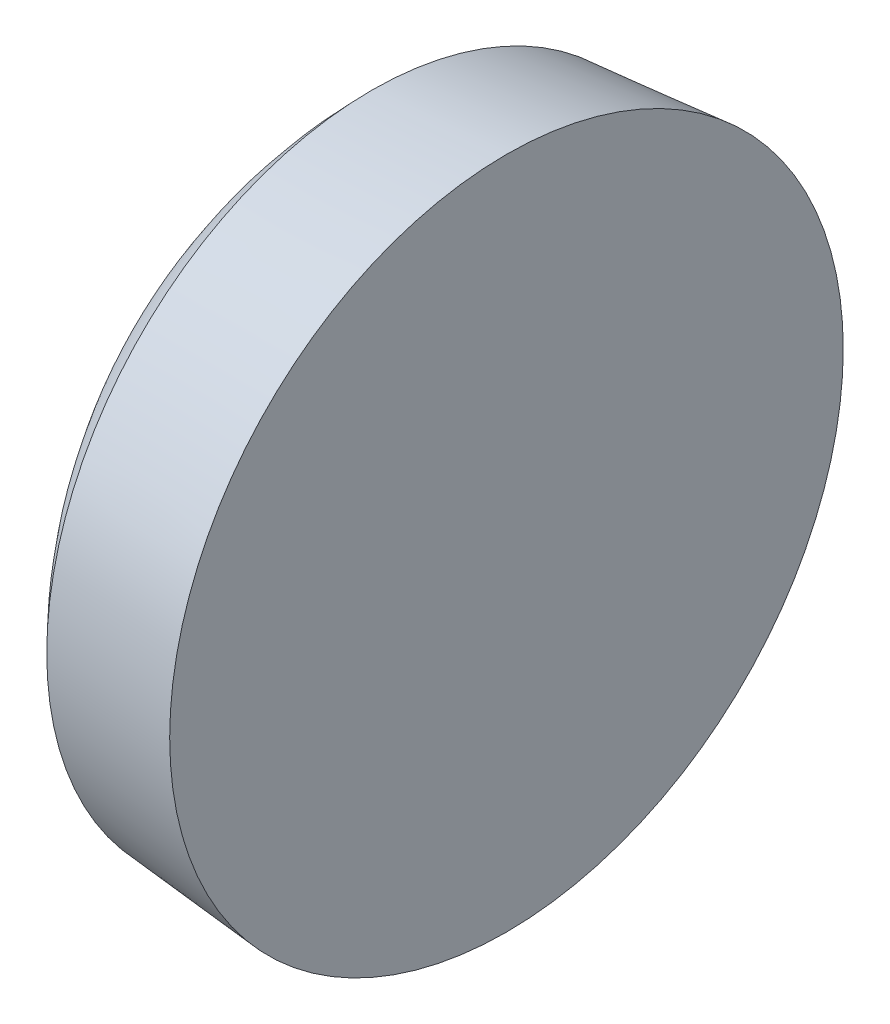
ISO-10303-21;
HEADER;
FILE_DESCRIPTION(('STEP AP214'),'2;1');
FILE_NAME('part.step','',(''),(''),'','','');
FILE_SCHEMA(('AUTOMOTIVE_DESIGN { 1 0 10303 214 1 1 1 1 }'));
ENDSEC;
DATA;
#1=APPLICATION_CONTEXT('core data for automotive mechanical design processes');
#2=APPLICATION_PROTOCOL_DEFINITION('international standard','automotive_design',2000,#1);
#3=PRODUCT_CONTEXT('',#1,'mechanical');
#4=PRODUCT('Part','Part','',(#3));
#5=PRODUCT_RELATED_PRODUCT_CATEGORY('part','',(#4));
#6=PRODUCT_DEFINITION_FORMATION('','',#4);
#7=PRODUCT_DEFINITION_CONTEXT('part definition',#1,'design');
#8=PRODUCT_DEFINITION('design','',#6,#7);
#9=PRODUCT_DEFINITION_SHAPE('','',#8);
#10=(LENGTH_UNIT() NAMED_UNIT(*) SI_UNIT(.MILLI.,.METRE.));
#11=(NAMED_UNIT(*) PLANE_ANGLE_UNIT() SI_UNIT($,.RADIAN.));
#12=(NAMED_UNIT(*) SI_UNIT($,.STERADIAN.) SOLID_ANGLE_UNIT());
#13=UNCERTAINTY_MEASURE_WITH_UNIT(LENGTH_MEASURE(1.E-05),#10,'distance_accuracy_value','');
#14=(GEOMETRIC_REPRESENTATION_CONTEXT(3) GLOBAL_UNCERTAINTY_ASSIGNED_CONTEXT((#13)) GLOBAL_UNIT_ASSIGNED_CONTEXT((#10,
#11,#12)) REPRESENTATION_CONTEXT('',''));
#15=CARTESIAN_POINT('',(0.,0.,0.));
#16=DIRECTION('',(0.,0.,1.));
#17=DIRECTION('',(1.,0.,0.));
#18=AXIS2_PLACEMENT_3D('',#15,#16,#17);
#19=CARTESIAN_POINT('',(60.9333333333333,6.9,10.));
#20=DIRECTION('',(-1.,0.,0.));
#21=DIRECTION('',(0.,0.,1.));
#22=AXIS2_PLACEMENT_3D('',#19,#20,#21);
#23=PLANE('',#22);
#24=DIRECTION('',(0.,0.,-1.));
#25=VECTOR('',#24,1.);
#26=CARTESIAN_POINT('',(60.9333333333333,7.85,10.));
#27=LINE('',#26,#25);
#28=CARTESIAN_POINT('',(60.9333333333333,7.85,9.82));
#29=VERTEX_POINT('',#28);
#30=CARTESIAN_POINT('',(60.9333333333333,7.85,10.18));
#31=VERTEX_POINT('',#30);
#32=EDGE_CURVE('E293',#29,#31,#27,.F.);
#33=ORIENTED_EDGE('',*,*,#32,.F.);
#34=DIRECTION('',(0.,1.,0.));
#35=VECTOR('',#34,1.);
#36=CARTESIAN_POINT('',(60.9333333333333,6.9,9.82));
#37=LINE('',#36,#35);
#38=CARTESIAN_POINT('',(60.9333333333333,7.08,9.82));
#39=VERTEX_POINT('',#38);
#40=EDGE_CURVE('E298',#39,#29,#37,.T.);
#41=ORIENTED_EDGE('',*,*,#40,.F.);
#42=DIRECTION('',(0.,0.,-1.));
#43=VECTOR('',#42,1.);
#44=CARTESIAN_POINT('',(60.9333333333333,7.08,10.));
#45=LINE('',#44,#43);
#46=CARTESIAN_POINT('',(60.9333333333333,7.08,9.05));
#47=VERTEX_POINT('',#46);
#48=EDGE_CURVE('E303',#47,#39,#45,.F.);
#49=ORIENTED_EDGE('',*,*,#48,.F.);
#50=DIRECTION('',(0.,1.,0.));
#51=VECTOR('',#50,1.);
#52=CARTESIAN_POINT('',(60.9333333333333,6.9,9.05));
#53=LINE('',#52,#51);
#54=CARTESIAN_POINT('',(60.9333333333333,6.72,9.05));
#55=VERTEX_POINT('',#54);
#56=EDGE_CURVE('E308',#55,#47,#53,.T.);
#57=ORIENTED_EDGE('',*,*,#56,.F.);
#58=DIRECTION('',(0.,0.,1.));
#59=VECTOR('',#58,1.);
#60=CARTESIAN_POINT('',(60.9333333333333,6.72,10.));
#61=LINE('',#60,#59);
#62=CARTESIAN_POINT('',(60.9333333333333,6.72,9.82));
#63=VERTEX_POINT('',#62);
#64=EDGE_CURVE('E313',#63,#55,#61,.F.);
#65=ORIENTED_EDGE('',*,*,#64,.F.);
#66=DIRECTION('',(0.,1.,0.));
#67=VECTOR('',#66,1.);
#68=CARTESIAN_POINT('',(60.9333333333333,6.9,9.82));
#69=LINE('',#68,#67);
#70=CARTESIAN_POINT('',(60.9333333333333,5.95,9.82));
#71=VERTEX_POINT('',#70);
#72=EDGE_CURVE('E318',#71,#63,#69,.T.);
#73=ORIENTED_EDGE('',*,*,#72,.F.);
#74=DIRECTION('',(0.,0.,-1.));
#75=VECTOR('',#74,1.);
#76=CARTESIAN_POINT('',(60.9333333333333,5.95,10.));
#77=LINE('',#76,#75);
#78=CARTESIAN_POINT('',(60.9333333333333,5.95,10.18));
#79=VERTEX_POINT('',#78);
#80=EDGE_CURVE('E267',#71,#79,#77,.F.);
#81=ORIENTED_EDGE('',*,*,#80,.T.);
#82=DIRECTION('',(0.,1.,0.));
#83=VECTOR('',#82,1.);
#84=CARTESIAN_POINT('',(60.9333333333333,6.9,10.18));
#85=LINE('',#84,#83);
#86=CARTESIAN_POINT('',(60.9333333333333,6.72,10.18));
#87=VERTEX_POINT('',#86);
#88=EDGE_CURVE('E264',#87,#79,#85,.F.);
#89=ORIENTED_EDGE('',*,*,#88,.F.);
#90=DIRECTION('',(0.,0.,1.));
#91=VECTOR('',#90,1.);
#92=CARTESIAN_POINT('',(60.9333333333333,6.72,10.));
#93=LINE('',#92,#91);
#94=CARTESIAN_POINT('',(60.9333333333333,6.72,10.95));
#95=VERTEX_POINT('',#94);
#96=EDGE_CURVE('E260',#95,#87,#93,.F.);
#97=ORIENTED_EDGE('',*,*,#96,.F.);
#98=DIRECTION('',(0.,1.,0.));
#99=VECTOR('',#98,1.);
#100=CARTESIAN_POINT('',(60.9333333333333,6.9,10.95));
#101=LINE('',#100,#99);
#102=CARTESIAN_POINT('',(60.9333333333333,7.08,10.95));
#103=VERTEX_POINT('',#102);
#104=EDGE_CURVE('E231',#95,#103,#101,.T.);
#105=ORIENTED_EDGE('',*,*,#104,.T.);
#106=DIRECTION('',(0.,0.,-1.));
#107=VECTOR('',#106,1.);
#108=CARTESIAN_POINT('',(60.9333333333333,7.08,10.));
#109=LINE('',#108,#107);
#110=CARTESIAN_POINT('',(60.9333333333333,7.08,10.18));
#111=VERTEX_POINT('',#110);
#112=EDGE_CURVE('E278',#111,#103,#109,.F.);
#113=ORIENTED_EDGE('',*,*,#112,.F.);
#114=DIRECTION('',(0.,1.,0.));
#115=VECTOR('',#114,1.);
#116=CARTESIAN_POINT('',(60.9333333333333,6.9,10.18));
#117=LINE('',#116,#115);
#118=EDGE_CURVE('E288',#31,#111,#117,.F.);
#119=ORIENTED_EDGE('',*,*,#118,.F.);
#120=EDGE_LOOP('',(#33,#41,#49,#57,#65,#73,#81,#89,#97,#105,#113,#119));
#121=FACE_BOUND('',#120,.T.);
#122=ADVANCED_FACE('F17',(#121),#23,.T.);
#123=CARTESIAN_POINT('',(60.3333333333333,6.72,10.));
#124=DIRECTION('',(0.,1.,0.));
#125=DIRECTION('',(0.,0.,1.));
#126=AXIS2_PLACEMENT_3D('',#123,#124,#125);
#127=PLANE('',#126);
#128=DIRECTION('',(1.,0.,0.));
#129=VECTOR('',#128,1.);
#130=CARTESIAN_POINT('',(60.3333333333333,6.72,10.95));
#131=LINE('',#130,#129);
#132=CARTESIAN_POINT('',(59.9104288101423,6.72,10.95));
#133=VERTEX_POINT('',#132);
#134=EDGE_CURVE('E89',#133,#95,#131,.T.);
#135=ORIENTED_EDGE('',*,*,#134,.T.);
#136=ORIENTED_EDGE('',*,*,#96,.T.);
#137=DIRECTION('',(-1.,0.,0.));
#138=VECTOR('',#137,1.);
#139=CARTESIAN_POINT('',(60.3333333333333,6.72,10.18));
#140=LINE('',#139,#138);
#141=CARTESIAN_POINT('',(59.7452357635393,6.72,10.18));
#142=VERTEX_POINT('',#141);
#143=EDGE_CURVE('E224',#142,#87,#140,.F.);
#144=ORIENTED_EDGE('',*,*,#143,.F.);
#145=CARTESIAN_POINT('',(59.9104288101423,6.72,10.95));
#146=CARTESIAN_POINT('',(59.8988837959489,6.72,10.9189995540506));
#147=CARTESIAN_POINT('',(59.8879044135648,6.72,10.8877884938067));
#148=CARTESIAN_POINT('',(59.8671312150263,6.72,10.8251104536469));
#149=CARTESIAN_POINT('',(59.857332908016,6.72,10.7936449620741));
#150=CARTESIAN_POINT('',(59.8389093673758,6.72,10.7304618501356));
#151=CARTESIAN_POINT('',(59.8302811277463,6.72,10.6987451062672));
#152=CARTESIAN_POINT('',(59.8141893785797,6.72,10.6350619663155));
#153=CARTESIAN_POINT('',(59.8067243497578,6.72,10.6030959541242));
#154=CARTESIAN_POINT('',(59.7929551713713,6.72,10.5389148788568));
#155=CARTESIAN_POINT('',(59.7866510218065,6.72,10.5066998157808));
#156=CARTESIAN_POINT('',(59.7752042744412,6.72,10.4420201537524));
#157=CARTESIAN_POINT('',(59.7700632196961,6.72,10.4095552817086));
#158=CARTESIAN_POINT('',(59.7609481710222,6.72,10.3443751591893));
#159=CARTESIAN_POINT('',(59.7569772780942,6.72,10.3116594750372));
#160=CARTESIAN_POINT('',(59.7502122911846,6.72,10.2459761632456));
#161=CARTESIAN_POINT('',(59.747422903366,6.72,10.2130080508538));
#162=CARTESIAN_POINT('',(59.7452357635393,6.72,10.18));
#163=B_SPLINE_CURVE_WITH_KNOTS('',3,(#145,#146,#147,#148,#149,#150,#151,#152,#153,#154,#155,
#156,#157,#158,#159,#160,#161,#162),.UNSPECIFIED.,.F.,.F.,(4,2,2,2,2,2,2,2,4),(0.,
0.0992357442434227,0.198081387639274,0.296668072480504,0.395124892694108,0.49358171290771,
0.592168397748939,0.691014041144791,0.790249785388211),.UNSPECIFIED.);
#164=EDGE_CURVE('E20',#133,#142,#163,.T.);
#165=ORIENTED_EDGE('',*,*,#164,.F.);
#166=EDGE_LOOP('',(#135,#136,#144,#165));
#167=FACE_BOUND('',#166,.T.);
#168=ADVANCED_FACE('F221',(#167),#127,.T.);
#169=CARTESIAN_POINT('',(60.3333333333333,6.9,10.18));
#170=DIRECTION('',(0.,0.,-1.));
#171=DIRECTION('',(-1.,0.,0.));
#172=AXIS2_PLACEMENT_3D('',#169,#170,#171);
#173=PLANE('',#172);
#174=ORIENTED_EDGE('',*,*,#88,.T.);
#175=DIRECTION('',(1.,0.,0.));
#176=VECTOR('',#175,1.);
#177=CARTESIAN_POINT('',(60.3333333333333,5.95,10.18));
#178=LINE('',#177,#176);
#179=CARTESIAN_POINT('',(59.9104288101423,5.95,10.18));
#180=VERTEX_POINT('',#179);
#181=EDGE_CURVE('E324',#79,#180,#178,.F.);
#182=ORIENTED_EDGE('',*,*,#181,.T.);
#183=CARTESIAN_POINT('',(59.7452357635393,6.72,10.18));
#184=CARTESIAN_POINT('',(59.7508899422282,6.63440991744419,10.18));
#185=CARTESIAN_POINT('',(59.7606214296282,6.54909652262232,10.18));
#186=CARTESIAN_POINT('',(59.7879885471447,6.38034093840232,10.18));
#187=CARTESIAN_POINT('',(59.8055701011838,6.29688998051805,10.18));
#188=CARTESIAN_POINT('',(59.8502992307462,6.12495750840955,10.18));
#189=CARTESIAN_POINT('',(59.8781352938419,6.03665468899654,10.18));
#190=CARTESIAN_POINT('',(59.9104288101423,5.94999999999999,10.18));
#191=B_SPLINE_CURVE_WITH_KNOTS('',3,(#183,#184,#185,#186,#187,#188,#189,#190),.UNSPECIFIED.,.F.,
.F.,(4,2,2,4),(0.,0.257221658829338,0.512698117737347,0.789983486231625),.UNSPECIFIED.);
#192=EDGE_CURVE('E213',#142,#180,#191,.T.);
#193=ORIENTED_EDGE('',*,*,#192,.F.);
#194=ORIENTED_EDGE('',*,*,#143,.T.);
#195=EDGE_LOOP('',(#174,#182,#193,#194));
#196=FACE_BOUND('',#195,.T.);
#197=ADVANCED_FACE('F204',(#196),#173,.T.);
#198=CARTESIAN_POINT('',(60.3333333333333,5.95,10.));
#199=DIRECTION('',(0.,-1.,0.));
#200=DIRECTION('',(0.,0.,-1.));
#201=AXIS2_PLACEMENT_3D('',#198,#199,#200);
#202=PLANE('',#201);
#203=ORIENTED_EDGE('',*,*,#181,.F.);
#204=ORIENTED_EDGE('',*,*,#80,.F.);
#205=DIRECTION('',(1.,0.,0.));
#206=VECTOR('',#205,1.);
#207=CARTESIAN_POINT('',(60.3333333333333,5.95,9.82));
#208=LINE('',#207,#206);
#209=CARTESIAN_POINT('',(59.9104288101423,5.94999999999999,9.82));
#210=VERTEX_POINT('',#209);
#211=EDGE_CURVE('E320',#210,#71,#208,.T.);
#212=ORIENTED_EDGE('',*,*,#211,.F.);
#213=CARTESIAN_POINT('',(59.9104288101423,5.95,10.18));
#214=CARTESIAN_POINT('',(59.9062004144439,5.94999999999998,10.12));
#215=CARTESIAN_POINT('',(59.9040862165948,5.94999999999998,10.06));
#216=CARTESIAN_POINT('',(59.9040862165948,5.95000000000002,9.93999999999996));
#217=CARTESIAN_POINT('',(59.9062004144439,5.95000000000006,9.87999999999995));
#218=CARTESIAN_POINT('',(59.9104288101423,5.95000000000011,9.81999999999994));
#219=B_SPLINE_CURVE_WITH_KNOTS('',3,(#213,#214,#215,#216,#217,#218),.UNSPECIFIED.,.F.,.F.,(4,2,
4),(0.,0.18011171114872,0.360223422297442),.UNSPECIFIED.);
#220=EDGE_CURVE('E207',#180,#210,#219,.T.);
#221=ORIENTED_EDGE('',*,*,#220,.F.);
#222=EDGE_LOOP('',(#203,#204,#212,#221));
#223=FACE_BOUND('',#222,.T.);
#224=ADVANCED_FACE('F199',(#223),#202,.F.);
#225=CARTESIAN_POINT('',(60.3333333333333,6.9,9.82));
#226=DIRECTION('',(0.,0.,1.));
#227=DIRECTION('',(1.,0.,0.));
#228=AXIS2_PLACEMENT_3D('',#225,#226,#227);
#229=PLANE('',#228);
#230=ORIENTED_EDGE('',*,*,#72,.T.);
#231=DIRECTION('',(1.,0.,0.));
#232=VECTOR('',#231,1.);
#233=CARTESIAN_POINT('',(60.3333333333333,6.72,9.82));
#234=LINE('',#233,#232);
#235=CARTESIAN_POINT('',(59.7452357635393,6.72,9.82));
#236=VERTEX_POINT('',#235);
#237=EDGE_CURVE('E315',#236,#63,#234,.T.);
#238=ORIENTED_EDGE('',*,*,#237,.F.);
#239=CARTESIAN_POINT('',(59.9104288101423,5.94999999999999,9.82));
#240=CARTESIAN_POINT('',(59.8988837959489,5.98100044594941,9.82));
#241=CARTESIAN_POINT('',(59.8879044135648,6.01221150619326,9.82));
#242=CARTESIAN_POINT('',(59.8671312150263,6.07488954635315,9.82));
#243=CARTESIAN_POINT('',(59.857332908016,6.10635503792594,9.82));
#244=CARTESIAN_POINT('',(59.8389093673758,6.1695381498644,9.82));
#245=CARTESIAN_POINT('',(59.8302811277463,6.20125489373276,9.82));
#246=CARTESIAN_POINT('',(59.8141893785797,6.2649380336845,9.82));
#247=CARTESIAN_POINT('',(59.8067243497578,6.29690404587582,9.82));
#248=CARTESIAN_POINT('',(59.7929551713713,6.36108512114317,9.82));
#249=CARTESIAN_POINT('',(59.7866510218065,6.3933001842192,9.82));
#250=CARTESIAN_POINT('',(59.7752042744412,6.45797984624761,9.82));
#251=CARTESIAN_POINT('',(59.7700632196961,6.49044471829143,9.82));
#252=CARTESIAN_POINT('',(59.7609481710222,6.55562484081068,9.82));
#253=CARTESIAN_POINT('',(59.7569772780942,6.58834052496277,9.82));
#254=CARTESIAN_POINT('',(59.7502122911846,6.6540238367544,9.82));
#255=CARTESIAN_POINT('',(59.747422903366,6.68699194914622,9.82));
#256=CARTESIAN_POINT('',(59.7452357635393,6.72,9.82));
#257=B_SPLINE_CURVE_WITH_KNOTS('',3,(#239,#240,#241,#242,#243,#244,#245,#246,#247,#248,#249,
#250,#251,#252,#253,#254,#255,#256),.UNSPECIFIED.,.F.,.F.,(4,2,2,2,2,2,2,2,4),(0.,
0.0992357442434227,0.198081387639273,0.296668072480502,0.395124892694105,0.493581712907707,
0.592168397748935,0.691014041144789,0.790249785388209),.UNSPECIFIED.);
#258=EDGE_CURVE('E184',#210,#236,#257,.T.);
#259=ORIENTED_EDGE('',*,*,#258,.F.);
#260=ORIENTED_EDGE('',*,*,#211,.T.);
#261=EDGE_LOOP('',(#230,#238,#259,#260));
#262=FACE_BOUND('',#261,.T.);
#263=ADVANCED_FACE('F194',(#262),#229,.T.);
#264=CARTESIAN_POINT('',(60.3333333333333,6.72,10.));
#265=DIRECTION('',(0.,1.,0.));
#266=DIRECTION('',(0.,0.,1.));
#267=AXIS2_PLACEMENT_3D('',#264,#265,#266);
#268=PLANE('',#267);
#269=DIRECTION('',(1.,0.,0.));
#270=VECTOR('',#269,1.);
#271=CARTESIAN_POINT('',(60.3333333333333,6.72,9.05));
#272=LINE('',#271,#270);
#273=CARTESIAN_POINT('',(59.9104288101423,6.72,9.05));
#274=VERTEX_POINT('',#273);
#275=EDGE_CURVE('E310',#274,#55,#272,.T.);
#276=ORIENTED_EDGE('',*,*,#275,.F.);
#277=CARTESIAN_POINT('',(59.7452357635393,6.72,9.82));
#278=CARTESIAN_POINT('',(59.7508899422282,6.72,9.73440991744418));
#279=CARTESIAN_POINT('',(59.7606214296282,6.72,9.64909652262232));
#280=CARTESIAN_POINT('',(59.7879885471447,6.72,9.48034093840232));
#281=CARTESIAN_POINT('',(59.8055701011838,6.72,9.39688998051805));
#282=CARTESIAN_POINT('',(59.8502992307462,6.72,9.22495750840955));
#283=CARTESIAN_POINT('',(59.8781352938419,6.72,9.13665468899655));
#284=CARTESIAN_POINT('',(59.9104288101423,6.72,9.05));
#285=B_SPLINE_CURVE_WITH_KNOTS('',3,(#277,#278,#279,#280,#281,#282,#283,#284),.UNSPECIFIED.,.F.,
.F.,(4,2,2,4),(0.,0.25722165882934,0.51269811773735,0.789983486231616),.UNSPECIFIED.);
#286=EDGE_CURVE('E176',#236,#274,#285,.T.);
#287=ORIENTED_EDGE('',*,*,#286,.F.);
#288=ORIENTED_EDGE('',*,*,#237,.T.);
#289=ORIENTED_EDGE('',*,*,#64,.T.);
#290=EDGE_LOOP('',(#276,#287,#288,#289));
#291=FACE_BOUND('',#290,.T.);
#292=ADVANCED_FACE('F191',(#291),#268,.T.);
#293=CARTESIAN_POINT('',(60.3333333333333,6.9,9.05));
#294=DIRECTION('',(0.,0.,1.));
#295=DIRECTION('',(1.,0.,0.));
#296=AXIS2_PLACEMENT_3D('',#293,#294,#295);
#297=PLANE('',#296);
#298=DIRECTION('',(1.,0.,0.));
#299=VECTOR('',#298,1.);
#300=CARTESIAN_POINT('',(60.3333333333333,7.08,9.05));
#301=LINE('',#300,#299);
#302=CARTESIAN_POINT('',(59.9104288101423,7.08,9.05));
#303=VERTEX_POINT('',#302);
#304=EDGE_CURVE('E305',#303,#47,#301,.T.);
#305=ORIENTED_EDGE('',*,*,#304,.F.);
#306=CARTESIAN_POINT('',(59.9104288101423,7.08,9.05));
#307=CARTESIAN_POINT('',(59.9040862165948,6.99011174581378,9.05));
#308=CARTESIAN_POINT('',(59.9040862165948,6.9,9.05));
#309=B_SPLINE_CURVE_WITH_KNOTS('',2,(#306,#307,#308),.UNSPECIFIED.,.F.,.F.,(3,3),(0.,1.),.UNSPECIFIED.);
#310=CARTESIAN_POINT('',(59.9040862165948,6.9,9.05));
#311=VERTEX_POINT('',#310);
#312=EDGE_CURVE('E175',#311,#303,#309,.F.);
#313=ORIENTED_EDGE('',*,*,#312,.F.);
#314=CARTESIAN_POINT('',(59.9040862165948,6.9,9.05));
#315=CARTESIAN_POINT('',(59.9040862165948,6.80988825418623,9.05));
#316=CARTESIAN_POINT('',(59.9104288101423,6.72,9.05));
#317=B_SPLINE_CURVE_WITH_KNOTS('',2,(#314,#315,#316),.UNSPECIFIED.,.F.,.F.,(3,3),(0.,1.),.UNSPECIFIED.);
#318=EDGE_CURVE('E183',#274,#311,#317,.F.);
#319=ORIENTED_EDGE('',*,*,#318,.F.);
#320=ORIENTED_EDGE('',*,*,#275,.T.);
#321=ORIENTED_EDGE('',*,*,#56,.T.);
#322=EDGE_LOOP('',(#305,#313,#319,#320,#321));
#323=FACE_BOUND('',#322,.T.);
#324=ADVANCED_FACE('F164',(#323),#297,.T.);
#325=CARTESIAN_POINT('',(60.3333333333333,7.08,10.));
#326=DIRECTION('',(0.,-1.,0.));
#327=DIRECTION('',(0.,0.,-1.));
#328=AXIS2_PLACEMENT_3D('',#325,#326,#327);
#329=PLANE('',#328);
#330=ORIENTED_EDGE('',*,*,#304,.T.);
#331=ORIENTED_EDGE('',*,*,#48,.T.);
#332=DIRECTION('',(1.,0.,0.));
#333=VECTOR('',#332,1.);
#334=CARTESIAN_POINT('',(60.3333333333333,7.08,9.82));
#335=LINE('',#334,#333);
#336=CARTESIAN_POINT('',(59.7452357635393,7.08,9.82));
#337=VERTEX_POINT('',#336);
#338=EDGE_CURVE('E300',#337,#39,#335,.T.);
#339=ORIENTED_EDGE('',*,*,#338,.F.);
#340=CARTESIAN_POINT('',(59.9104288101423,7.08,9.04999999999999));
#341=CARTESIAN_POINT('',(59.8988837959489,7.08,9.08100044594941));
#342=CARTESIAN_POINT('',(59.8879044135648,7.08,9.11221150619326));
#343=CARTESIAN_POINT('',(59.8671312150263,7.08,9.17488954635315));
#344=CARTESIAN_POINT('',(59.857332908016,7.08,9.20635503792594));
#345=CARTESIAN_POINT('',(59.8389093673758,7.08,9.2695381498644));
#346=CARTESIAN_POINT('',(59.8302811277463,7.08,9.30125489373276));
#347=CARTESIAN_POINT('',(59.8141893785797,7.08,9.3649380336845));
#348=CARTESIAN_POINT('',(59.8067243497578,7.08,9.39690404587582));
#349=CARTESIAN_POINT('',(59.7929551713712,7.08,9.46108512114317));
#350=CARTESIAN_POINT('',(59.7866510218065,7.08,9.4933001842192));
#351=CARTESIAN_POINT('',(59.7752042744412,7.08,9.55797984624761));
#352=CARTESIAN_POINT('',(59.7700632196961,7.08,9.59044471829143));
#353=CARTESIAN_POINT('',(59.7609481710222,7.08,9.65562484081068));
#354=CARTESIAN_POINT('',(59.7569772780942,7.08,9.68834052496277));
#355=CARTESIAN_POINT('',(59.7502122911846,7.08,9.7540238367544));
#356=CARTESIAN_POINT('',(59.747422903366,7.08,9.78699194914622));
#357=CARTESIAN_POINT('',(59.7452357635393,7.08,9.82));
#358=B_SPLINE_CURVE_WITH_KNOTS('',3,(#340,#341,#342,#343,#344,#345,#346,#347,#348,#349,#350,
#351,#352,#353,#354,#355,#356,#357),.UNSPECIFIED.,.F.,.F.,(4,2,2,2,2,2,2,2,4),(0.,
0.0992357442434204,0.198081387639275,0.296668072480506,0.395124892694108,0.493581712907711,
0.592168397748939,0.691014041144793,0.790249785388215),.UNSPECIFIED.);
#359=EDGE_CURVE('E168',#303,#337,#358,.T.);
#360=ORIENTED_EDGE('',*,*,#359,.F.);
#361=EDGE_LOOP('',(#330,#331,#339,#360));
#362=FACE_BOUND('',#361,.T.);
#363=ADVANCED_FACE('F159',(#362),#329,.T.);
#364=CARTESIAN_POINT('',(60.3333333333333,6.9,9.82));
#365=DIRECTION('',(0.,0.,1.));
#366=DIRECTION('',(1.,0.,0.));
#367=AXIS2_PLACEMENT_3D('',#364,#365,#366);
#368=PLANE('',#367);
#369=ORIENTED_EDGE('',*,*,#40,.T.);
#370=DIRECTION('',(1.,0.,0.));
#371=VECTOR('',#370,1.);
#372=CARTESIAN_POINT('',(60.3333333333333,7.85,9.82));
#373=LINE('',#372,#371);
#374=CARTESIAN_POINT('',(59.9104288101423,7.85,9.82));
#375=VERTEX_POINT('',#374);
#376=EDGE_CURVE('E295',#375,#29,#373,.T.);
#377=ORIENTED_EDGE('',*,*,#376,.F.);
#378=CARTESIAN_POINT('',(59.7452357635393,7.08,9.82));
#379=CARTESIAN_POINT('',(59.7508899422282,7.16559008255582,9.82));
#380=CARTESIAN_POINT('',(59.7606214296282,7.25090347737769,9.82));
#381=CARTESIAN_POINT('',(59.7879885471447,7.41965906159768,9.82));
#382=CARTESIAN_POINT('',(59.8055701011838,7.50311001948195,9.82));
#383=CARTESIAN_POINT('',(59.8502992307462,7.67504249159045,9.82));
#384=CARTESIAN_POINT('',(59.8781352938419,7.76334531100346,9.82));
#385=CARTESIAN_POINT('',(59.9104288101423,7.85000000000001,9.82));
#386=B_SPLINE_CURVE_WITH_KNOTS('',3,(#378,#379,#380,#381,#382,#383,#384,#385),.UNSPECIFIED.,.F.,
.F.,(4,2,2,4),(0.,0.257221658829339,0.512698117737348,0.789983486231616),.UNSPECIFIED.);
#387=EDGE_CURVE('E144',#337,#375,#386,.T.);
#388=ORIENTED_EDGE('',*,*,#387,.F.);
#389=ORIENTED_EDGE('',*,*,#338,.T.);
#390=EDGE_LOOP('',(#369,#377,#388,#389));
#391=FACE_BOUND('',#390,.T.);
#392=ADVANCED_FACE('F154',(#391),#368,.T.);
#393=CARTESIAN_POINT('',(60.3333333333333,7.85,10.));
#394=DIRECTION('',(0.,-1.,0.));
#395=DIRECTION('',(0.,0.,-1.));
#396=AXIS2_PLACEMENT_3D('',#393,#394,#395);
#397=PLANE('',#396);
#398=ORIENTED_EDGE('',*,*,#32,.T.);
#399=DIRECTION('',(-1.,0.,0.));
#400=VECTOR('',#399,1.);
#401=CARTESIAN_POINT('',(60.3333333333333,7.85,10.18));
#402=LINE('',#401,#400);
#403=CARTESIAN_POINT('',(59.9104288101423,7.85000000000001,10.18));
#404=VERTEX_POINT('',#403);
#405=EDGE_CURVE('E290',#404,#31,#402,.F.);
#406=ORIENTED_EDGE('',*,*,#405,.F.);
#407=CARTESIAN_POINT('',(59.9104288101423,7.85,9.82));
#408=CARTESIAN_POINT('',(59.9062004144439,7.85000000000001,9.88000000000001));
#409=CARTESIAN_POINT('',(59.9040862165948,7.85000000000001,9.94000000000002));
#410=CARTESIAN_POINT('',(59.9040862165948,7.84999999999999,10.06));
#411=CARTESIAN_POINT('',(59.9062004144439,7.84999999999997,10.1200000000001));
#412=CARTESIAN_POINT('',(59.9104288101422,7.84999999999994,10.1800000000001));
#413=B_SPLINE_CURVE_WITH_KNOTS('',3,(#407,#408,#409,#410,#411,#412),.UNSPECIFIED.,.F.,.F.,(4,2,
4),(0.,0.180111711148723,0.360223422297444),.UNSPECIFIED.);
#414=EDGE_CURVE('E137',#375,#404,#413,.T.);
#415=ORIENTED_EDGE('',*,*,#414,.F.);
#416=ORIENTED_EDGE('',*,*,#376,.T.);
#417=EDGE_LOOP('',(#398,#406,#415,#416));
#418=FACE_BOUND('',#417,.T.);
#419=ADVANCED_FACE('F151',(#418),#397,.T.);
#420=CARTESIAN_POINT('',(60.3333333333333,6.9,10.18));
#421=DIRECTION('',(0.,0.,-1.));
#422=DIRECTION('',(-1.,0.,0.));
#423=AXIS2_PLACEMENT_3D('',#420,#421,#422);
#424=PLANE('',#423);
#425=ORIENTED_EDGE('',*,*,#118,.T.);
#426=DIRECTION('',(1.,0.,0.));
#427=VECTOR('',#426,1.);
#428=CARTESIAN_POINT('',(60.3333333333333,7.08,10.18));
#429=LINE('',#428,#427);
#430=CARTESIAN_POINT('',(59.7452357635393,7.08,10.18));
#431=VERTEX_POINT('',#430);
#432=EDGE_CURVE('E280',#431,#111,#429,.T.);
#433=ORIENTED_EDGE('',*,*,#432,.F.);
#434=CARTESIAN_POINT('',(59.9104288101423,7.85000000000001,10.18));
#435=CARTESIAN_POINT('',(59.8988837959489,7.81899955405059,10.18));
#436=CARTESIAN_POINT('',(59.8879044135648,7.78778849380673,10.18));
#437=CARTESIAN_POINT('',(59.8671312150263,7.72511045364685,10.18));
#438=CARTESIAN_POINT('',(59.857332908016,7.69364496207406,10.18));
#439=CARTESIAN_POINT('',(59.8389093673758,7.6304618501356,10.18));
#440=CARTESIAN_POINT('',(59.8302811277463,7.59874510626724,10.18));
#441=CARTESIAN_POINT('',(59.8141893785797,7.5350619663155,10.18));
#442=CARTESIAN_POINT('',(59.8067243497578,7.50309595412419,10.18));
#443=CARTESIAN_POINT('',(59.7929551713712,7.43891487885683,10.18));
#444=CARTESIAN_POINT('',(59.7866510218065,7.4066998157808,10.18));
#445=CARTESIAN_POINT('',(59.7752042744412,7.34202015375239,10.18));
#446=CARTESIAN_POINT('',(59.7700632196961,7.30955528170857,10.18));
#447=CARTESIAN_POINT('',(59.7609481710222,7.24437515918932,10.18));
#448=CARTESIAN_POINT('',(59.7569772780941,7.21165947503723,10.18));
#449=CARTESIAN_POINT('',(59.7502122911846,7.1459761632456,10.18));
#450=CARTESIAN_POINT('',(59.747422903366,7.11300805085378,10.18));
#451=CARTESIAN_POINT('',(59.7452357635393,7.08,10.18));
#452=B_SPLINE_CURVE_WITH_KNOTS('',3,(#434,#435,#436,#437,#438,#439,#440,#441,#442,#443,#444,
#445,#446,#447,#448,#449,#450,#451),.UNSPECIFIED.,.F.,.F.,(4,2,2,2,2,2,2,2,4),(0.,
0.099235744243422,0.198081387639272,0.296668072480501,0.395124892694104,0.493581712907706,
0.592168397748932,0.691014041144787,0.790249785388207),.UNSPECIFIED.);
#453=EDGE_CURVE('E100',#404,#431,#452,.T.);
#454=ORIENTED_EDGE('',*,*,#453,.F.);
#455=ORIENTED_EDGE('',*,*,#405,.T.);
#456=EDGE_LOOP('',(#425,#433,#454,#455));
#457=FACE_BOUND('',#456,.T.);
#458=ADVANCED_FACE('F123',(#457),#424,.T.);
#459=CARTESIAN_POINT('',(60.3333333333333,7.08,10.));
#460=DIRECTION('',(0.,-1.,0.));
#461=DIRECTION('',(0.,0.,-1.));
#462=AXIS2_PLACEMENT_3D('',#459,#460,#461);
#463=PLANE('',#462);
#464=DIRECTION('',(1.,0.,0.));
#465=VECTOR('',#464,1.);
#466=CARTESIAN_POINT('',(60.3333333333333,7.08,10.95));
#467=LINE('',#466,#465);
#468=CARTESIAN_POINT('',(59.9104288101423,7.08,10.95));
#469=VERTEX_POINT('',#468);
#470=EDGE_CURVE('E40',#103,#469,#467,.F.);
#471=ORIENTED_EDGE('',*,*,#470,.T.);
#472=CARTESIAN_POINT('',(59.7452357635393,7.08,10.18));
#473=CARTESIAN_POINT('',(59.7508899422282,7.08,10.2655900825558));
#474=CARTESIAN_POINT('',(59.7606214296282,7.08,10.3509034773777));
#475=CARTESIAN_POINT('',(59.7879885471447,7.08,10.5196590615977));
#476=CARTESIAN_POINT('',(59.8055701011838,7.08,10.6031100194819));
#477=CARTESIAN_POINT('',(59.8502992307462,7.08,10.7750424915904));
#478=CARTESIAN_POINT('',(59.878135293842,7.08,10.8633453110035));
#479=CARTESIAN_POINT('',(59.9104288101423,7.08,10.95));
#480=B_SPLINE_CURVE_WITH_KNOTS('',3,(#472,#473,#474,#475,#476,#477,#478,#479),.UNSPECIFIED.,.F.,
.F.,(4,2,2,4),(0.,0.257221658829336,0.512698117737344,0.78998348623163),.UNSPECIFIED.);
#481=EDGE_CURVE('E96',#431,#469,#480,.T.);
#482=ORIENTED_EDGE('',*,*,#481,.F.);
#483=ORIENTED_EDGE('',*,*,#432,.T.);
#484=ORIENTED_EDGE('',*,*,#112,.T.);
#485=EDGE_LOOP('',(#471,#482,#483,#484));
#486=FACE_BOUND('',#485,.T.);
#487=ADVANCED_FACE('F115',(#486),#463,.T.);
#488=CARTESIAN_POINT('',(60.3333333333333,6.9,10.95));
#489=DIRECTION('',(0.,0.,1.));
#490=DIRECTION('',(1.,0.,0.));
#491=AXIS2_PLACEMENT_3D('',#488,#489,#490);
#492=PLANE('',#491);
#493=ORIENTED_EDGE('',*,*,#470,.F.);
#494=ORIENTED_EDGE('',*,*,#104,.F.);
#495=ORIENTED_EDGE('',*,*,#134,.F.);
#496=CARTESIAN_POINT('',(59.9040862165948,6.9,10.95));
#497=CARTESIAN_POINT('',(59.9040862165948,6.80988825418623,10.95));
#498=CARTESIAN_POINT('',(59.9104288101423,6.72,10.95));
#499=B_SPLINE_CURVE_WITH_KNOTS('',2,(#496,#497,#498),.UNSPECIFIED.,.F.,.F.,(3,3),(0.,1.),.UNSPECIFIED.);
#500=CARTESIAN_POINT('',(59.9040862165948,6.9,10.95));
#501=VERTEX_POINT('',#500);
#502=EDGE_CURVE('E82',#501,#133,#499,.T.);
#503=ORIENTED_EDGE('',*,*,#502,.F.);
#504=CARTESIAN_POINT('',(59.9104288101423,7.08,10.95));
#505=CARTESIAN_POINT('',(59.9040862165948,6.99011174581378,10.95));
#506=CARTESIAN_POINT('',(59.9040862165948,6.9,10.95));
#507=B_SPLINE_CURVE_WITH_KNOTS('',2,(#504,#505,#506),.UNSPECIFIED.,.F.,.F.,(3,3),(0.,1.),.UNSPECIFIED.);
#508=EDGE_CURVE('E85',#469,#501,#507,.T.);
#509=ORIENTED_EDGE('',*,*,#508,.F.);
#510=EDGE_LOOP('',(#493,#494,#495,#503,#509));
#511=FACE_BOUND('',#510,.T.);
#512=ADVANCED_FACE('F84',(#511),#492,.F.);
#513=CARTESIAN_POINT('',(62.4614177127797,6.9,10.));
#514=DIRECTION('',(1.,0.,0.));
#515=DIRECTION('',(0.,1.,0.));
#516=AXIS2_PLACEMENT_3D('',#513,#514,#515);
#517=SPHERICAL_SURFACE('',#516,2.72808437944638);
#518=CARTESIAN_POINT('',(60.5333333333533,6.9,10.));
#519=DIRECTION('',(1.,0.,0.));
#520=DIRECTION('',(0.,0.,1.));
#521=AXIS2_PLACEMENT_3D('',#518,#519,#520);
#522=CIRCLE('',#521,1.93000906918229);
#523=CARTESIAN_POINT('',(60.5333333333533,6.90000000000007,11.9300090691823));
#524=VERTEX_POINT('',#523);
#525=EDGE_CURVE('E31',#524,#524,#522,.T.);
#526=ORIENTED_EDGE('',*,*,#525,.F.);
#527=EDGE_LOOP('',(#526));
#528=FACE_BOUND('',#527,.T.);
#529=ORIENTED_EDGE('',*,*,#481,.T.);
#530=ORIENTED_EDGE('',*,*,#508,.T.);
#531=ORIENTED_EDGE('',*,*,#502,.T.);
#532=ORIENTED_EDGE('',*,*,#164,.T.);
#533=ORIENTED_EDGE('',*,*,#192,.T.);
#534=ORIENTED_EDGE('',*,*,#220,.T.);
#535=ORIENTED_EDGE('',*,*,#258,.T.);
#536=ORIENTED_EDGE('',*,*,#286,.T.);
#537=ORIENTED_EDGE('',*,*,#318,.T.);
#538=ORIENTED_EDGE('',*,*,#312,.T.);
#539=ORIENTED_EDGE('',*,*,#359,.T.);
#540=ORIENTED_EDGE('',*,*,#387,.T.);
#541=ORIENTED_EDGE('',*,*,#414,.T.);
#542=ORIENTED_EDGE('',*,*,#453,.T.);
#543=EDGE_LOOP('',(#529,#530,#531,#532,#533,#534,#535,#536,#537,#538,#539,#540,#541,#542));
#544=FACE_BOUND('',#543,.T.);
#545=ADVANCED_FACE('F94',(#528,#544),#517,.T.);
#546=CARTESIAN_POINT('',(61.3333333333799,6.9,10.));
#547=DIRECTION('',(1.,0.,0.));
#548=DIRECTION('',(0.,1.,0.));
#549=AXIS2_PLACEMENT_3D('',#546,#547,#548);
#550=CONICAL_SURFACE('',#549,2.00000000000756,0.0872664626024547);
#551=CARTESIAN_POINT('',(61.333333333323,6.9,10.));
#552=DIRECTION('',(1.,0.,0.));
#553=DIRECTION('',(0.,1.,0.));
#554=AXIS2_PLACEMENT_3D('',#551,#552,#553);
#555=CIRCLE('',#554,2.00000000000259);
#556=CARTESIAN_POINT('',(61.333333333323,8.90000000000259,10.));
#557=VERTEX_POINT('',#556);
#558=EDGE_CURVE('E11',#557,#557,#555,.T.);
#559=ORIENTED_EDGE('',*,*,#558,.F.);
#560=EDGE_LOOP('',(#559));
#561=FACE_BOUND('',#560,.T.);
#562=ORIENTED_EDGE('',*,*,#525,.T.);
#563=EDGE_LOOP('',(#562));
#564=FACE_BOUND('',#563,.T.);
#565=ADVANCED_FACE('F402',(#561,#564),#550,.T.);
#566=CARTESIAN_POINT('',(61.3333333333333,6.9,11.));
#567=DIRECTION('',(1.,0.,0.));
#568=DIRECTION('',(0.,0.,-1.));
#569=AXIS2_PLACEMENT_3D('',#566,#567,#568);
#570=PLANE('',#569);
#571=ORIENTED_EDGE('',*,*,#558,.T.);
#572=EDGE_LOOP('',(#571));
#573=FACE_BOUND('',#572,.T.);
#574=ADVANCED_FACE('F400',(#573),#570,.T.);
#575=CLOSED_SHELL('',(#122,#168,#197,#224,#263,#292,#324,#363,#392,#419,#458,#487,#512,#545,
#565,#574));
#576=MANIFOLD_SOLID_BREP('B1',#575);
#577=ADVANCED_BREP_SHAPE_REPRESENTATION('',(#18,#576),#14);
#578=SHAPE_DEFINITION_REPRESENTATION(#9,#577);
ENDSEC;
END-ISO-10303-21;
